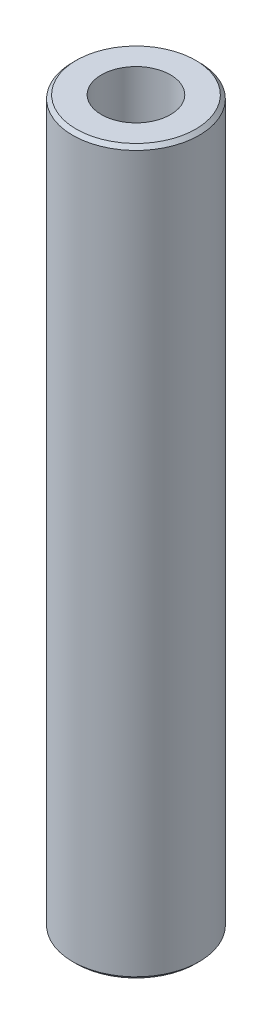
ISO-10303-21;
HEADER;
FILE_DESCRIPTION(('STEP AP214'),'2;1');
FILE_NAME('part.step','',(''),(''),'','','');
FILE_SCHEMA(('AUTOMOTIVE_DESIGN { 1 0 10303 214 1 1 1 1 }'));
ENDSEC;
DATA;
#1=APPLICATION_CONTEXT('core data for automotive mechanical design processes');
#2=APPLICATION_PROTOCOL_DEFINITION('international standard','automotive_design',2000,#1);
#3=PRODUCT_CONTEXT('',#1,'mechanical');
#4=PRODUCT('Part','Part','',(#3));
#5=PRODUCT_RELATED_PRODUCT_CATEGORY('part','',(#4));
#6=PRODUCT_DEFINITION_FORMATION('','',#4);
#7=PRODUCT_DEFINITION_CONTEXT('part definition',#1,'design');
#8=PRODUCT_DEFINITION('design','',#6,#7);
#9=PRODUCT_DEFINITION_SHAPE('','',#8);
#10=(LENGTH_UNIT() NAMED_UNIT(*) SI_UNIT(.MILLI.,.METRE.));
#11=(NAMED_UNIT(*) PLANE_ANGLE_UNIT() SI_UNIT($,.RADIAN.));
#12=(NAMED_UNIT(*) SI_UNIT($,.STERADIAN.) SOLID_ANGLE_UNIT());
#13=UNCERTAINTY_MEASURE_WITH_UNIT(LENGTH_MEASURE(1.E-05),#10,'distance_accuracy_value','');
#14=(GEOMETRIC_REPRESENTATION_CONTEXT(3) GLOBAL_UNCERTAINTY_ASSIGNED_CONTEXT((#13)) GLOBAL_UNIT_ASSIGNED_CONTEXT((#10,
#11,#12)) REPRESENTATION_CONTEXT('',''));
#15=CARTESIAN_POINT('',(0.,0.,0.));
#16=DIRECTION('',(0.,0.,1.));
#17=DIRECTION('',(1.,0.,0.));
#18=AXIS2_PLACEMENT_3D('',#15,#16,#17);
#19=CARTESIAN_POINT('',(0.,600.,0.));
#20=DIRECTION('',(0.,-1.,0.));
#21=DIRECTION('',(0.,0.,-1.));
#22=AXIS2_PLACEMENT_3D('',#19,#20,#21);
#23=CYLINDRICAL_SURFACE('',#22,52.5);
#24=CARTESIAN_POINT('',(0.,597.047422723443,0.));
#25=DIRECTION('',(0.,1.,0.));
#26=DIRECTION('',(0.,0.,1.));
#27=AXIS2_PLACEMENT_3D('',#24,#25,#26);
#28=CIRCLE('',#27,52.5);
#29=CARTESIAN_POINT('',(0.,597.047422723443,52.5));
#30=VERTEX_POINT('',#29);
#31=EDGE_CURVE('E50',#30,#30,#28,.F.);
#32=ORIENTED_EDGE('',*,*,#31,.T.);
#33=EDGE_LOOP('',(#32));
#34=FACE_BOUND('',#33,.T.);
#35=CARTESIAN_POINT('',(0.,2.95257727655696,0.));
#36=DIRECTION('',(0.,1.,0.));
#37=DIRECTION('',(0.,0.,1.));
#38=AXIS2_PLACEMENT_3D('',#35,#36,#37);
#39=CIRCLE('',#38,52.5);
#40=CARTESIAN_POINT('',(0.,2.95257727655696,52.5));
#41=VERTEX_POINT('',#40);
#42=EDGE_CURVE('E51',#41,#41,#39,.T.);
#43=ORIENTED_EDGE('',*,*,#42,.T.);
#44=EDGE_LOOP('',(#43));
#45=FACE_BOUND('',#44,.T.);
#46=ADVANCED_FACE('F39',(#34,#45),#23,.T.);
#47=CARTESIAN_POINT('',(0.,600.,0.));
#48=DIRECTION('',(0.,1.,0.));
#49=DIRECTION('',(0.,0.,1.));
#50=AXIS2_PLACEMENT_3D('',#47,#48,#49);
#51=PLANE('',#50);
#52=CARTESIAN_POINT('',(0.,600.,0.));
#53=DIRECTION('',(0.,1.,0.));
#54=DIRECTION('',(0.,0.,1.));
#55=AXIS2_PLACEMENT_3D('',#52,#53,#54);
#56=CIRCLE('',#55,49.547422723443);
#57=CARTESIAN_POINT('',(0.,600.,49.547422723443));
#58=VERTEX_POINT('',#57);
#59=EDGE_CURVE('E54',#58,#58,#56,.T.);
#60=ORIENTED_EDGE('',*,*,#59,.T.);
#61=EDGE_LOOP('',(#60));
#62=FACE_BOUND('',#61,.T.);
#63=CARTESIAN_POINT('',(0.,600.,0.));
#64=DIRECTION('',(0.,1.,0.));
#65=DIRECTION('',(0.,0.,1.));
#66=AXIS2_PLACEMENT_3D('',#63,#64,#65);
#67=CIRCLE('',#66,28.6669340080081);
#68=CARTESIAN_POINT('',(0.,600.,28.6669340080081));
#69=VERTEX_POINT('',#68);
#70=EDGE_CURVE('E58',#69,#69,#67,.T.);
#71=ORIENTED_EDGE('',*,*,#70,.F.);
#72=EDGE_LOOP('',(#71));
#73=FACE_BOUND('',#72,.T.);
#74=ADVANCED_FACE('F69',(#62,#73),#51,.T.);
#75=CARTESIAN_POINT('',(0.,0.,0.));
#76=DIRECTION('',(0.,1.,0.));
#77=DIRECTION('',(0.,0.,1.));
#78=AXIS2_PLACEMENT_3D('',#75,#76,#77);
#79=PLANE('',#78);
#80=CARTESIAN_POINT('',(0.,0.,0.));
#81=DIRECTION('',(0.,1.,0.));
#82=DIRECTION('',(0.,0.,1.));
#83=AXIS2_PLACEMENT_3D('',#80,#81,#82);
#84=CIRCLE('',#83,49.547422723443);
#85=CARTESIAN_POINT('',(0.,0.,49.547422723443));
#86=VERTEX_POINT('',#85);
#87=EDGE_CURVE('E10',#86,#86,#84,.F.);
#88=ORIENTED_EDGE('',*,*,#87,.T.);
#89=EDGE_LOOP('',(#88));
#90=FACE_BOUND('',#89,.T.);
#91=CARTESIAN_POINT('',(0.,0.,0.));
#92=DIRECTION('',(0.,1.,0.));
#93=DIRECTION('',(0.,0.,1.));
#94=AXIS2_PLACEMENT_3D('',#91,#92,#93);
#95=CIRCLE('',#94,28.6669340080081);
#96=CARTESIAN_POINT('',(0.,0.,28.6669340080081));
#97=VERTEX_POINT('',#96);
#98=EDGE_CURVE('E63',#97,#97,#95,.T.);
#99=ORIENTED_EDGE('',*,*,#98,.T.);
#100=EDGE_LOOP('',(#99));
#101=FACE_BOUND('',#100,.T.);
#102=ADVANCED_FACE('F75',(#90,#101),#79,.F.);
#103=CARTESIAN_POINT('',(0.,600.,0.));
#104=DIRECTION('',(0.,-1.,0.));
#105=DIRECTION('',(0.,0.,-1.));
#106=AXIS2_PLACEMENT_3D('',#103,#104,#105);
#107=CYLINDRICAL_SURFACE('',#106,28.6669340080081);
#108=ORIENTED_EDGE('',*,*,#70,.T.);
#109=EDGE_LOOP('',(#108));
#110=FACE_BOUND('',#109,.T.);
#111=ORIENTED_EDGE('',*,*,#98,.F.);
#112=EDGE_LOOP('',(#111));
#113=FACE_BOUND('',#112,.T.);
#114=ADVANCED_FACE('F70',(#110,#113),#107,.F.);
#115=CARTESIAN_POINT('',(0.,600.,0.));
#116=DIRECTION('',(0.,-1.,0.));
#117=DIRECTION('',(0.,0.,-1.));
#118=AXIS2_PLACEMENT_3D('',#115,#116,#117);
#119=CONICAL_SURFACE('',#118,49.547422723443,0.785398163397468);
#120=ORIENTED_EDGE('',*,*,#31,.F.);
#121=EDGE_LOOP('',(#120));
#122=FACE_BOUND('',#121,.T.);
#123=ORIENTED_EDGE('',*,*,#59,.F.);
#124=EDGE_LOOP('',(#123));
#125=FACE_BOUND('',#124,.T.);
#126=ADVANCED_FACE('F81',(#122,#125),#119,.T.);
#127=CARTESIAN_POINT('',(0.,2.95257727655696,0.));
#128=DIRECTION('',(0.,1.,0.));
#129=DIRECTION('',(0.,0.,1.));
#130=AXIS2_PLACEMENT_3D('',#127,#128,#129);
#131=CONICAL_SURFACE('',#130,52.5,0.785398163397459);
#132=ORIENTED_EDGE('',*,*,#87,.F.);
#133=EDGE_LOOP('',(#132));
#134=FACE_BOUND('',#133,.T.);
#135=ORIENTED_EDGE('',*,*,#42,.F.);
#136=EDGE_LOOP('',(#135));
#137=FACE_BOUND('',#136,.T.);
#138=ADVANCED_FACE('F45',(#134,#137),#131,.T.);
#139=CLOSED_SHELL('',(#46,#74,#102,#114,#126,#138));
#140=MANIFOLD_SOLID_BREP('B2',#139);
#141=ADVANCED_BREP_SHAPE_REPRESENTATION('',(#18,#140),#14);
#142=SHAPE_DEFINITION_REPRESENTATION(#9,#141);
ENDSEC;
END-ISO-10303-21;
